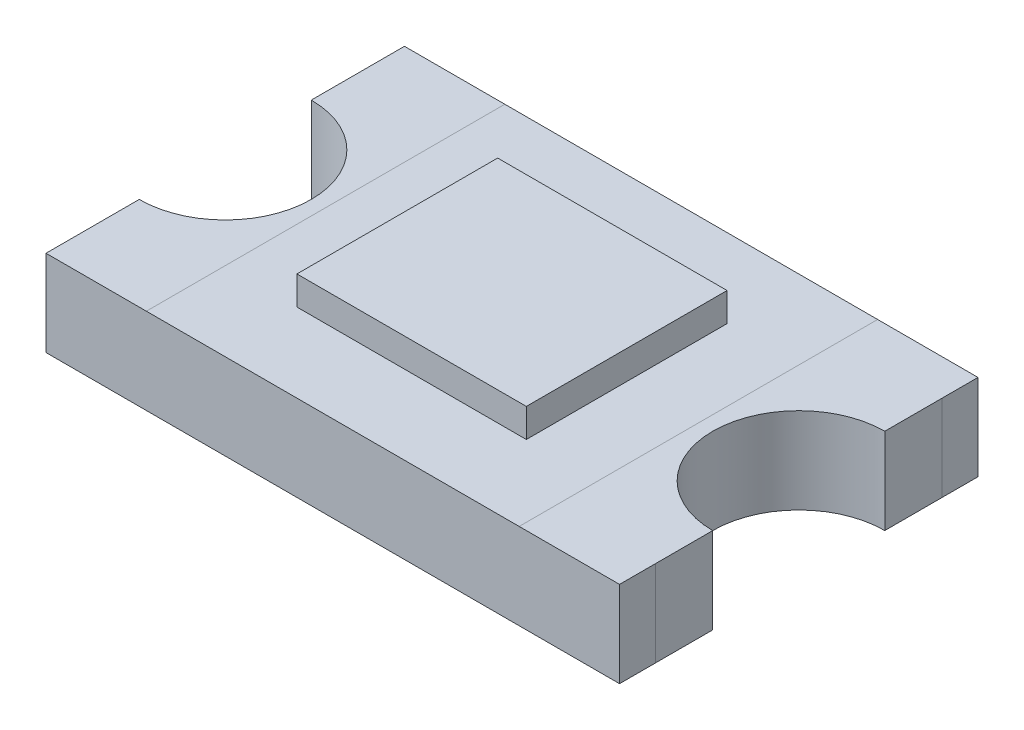
ISO-10303-21;
HEADER;
FILE_DESCRIPTION(('STEP AP214'),'2;1');
FILE_NAME('part.step','',(''),(''),'','','');
FILE_SCHEMA(('AUTOMOTIVE_DESIGN { 1 0 10303 214 1 1 1 1 }'));
ENDSEC;
DATA;
#1=APPLICATION_CONTEXT('core data for automotive mechanical design processes');
#2=APPLICATION_PROTOCOL_DEFINITION('international standard','automotive_design',2000,#1);
#3=PRODUCT_CONTEXT('',#1,'mechanical');
#4=PRODUCT('Part','Part','',(#3));
#5=PRODUCT_RELATED_PRODUCT_CATEGORY('part','',(#4));
#6=PRODUCT_DEFINITION_FORMATION('','',#4);
#7=PRODUCT_DEFINITION_CONTEXT('part definition',#1,'design');
#8=PRODUCT_DEFINITION('design','',#6,#7);
#9=PRODUCT_DEFINITION_SHAPE('','',#8);
#10=(LENGTH_UNIT() NAMED_UNIT(*) SI_UNIT(.MILLI.,.METRE.));
#11=(NAMED_UNIT(*) PLANE_ANGLE_UNIT() SI_UNIT($,.RADIAN.));
#12=(NAMED_UNIT(*) SI_UNIT($,.STERADIAN.) SOLID_ANGLE_UNIT());
#13=UNCERTAINTY_MEASURE_WITH_UNIT(LENGTH_MEASURE(1.E-05),#10,'distance_accuracy_value','');
#14=(GEOMETRIC_REPRESENTATION_CONTEXT(3) GLOBAL_UNCERTAINTY_ASSIGNED_CONTEXT((#13)) GLOBAL_UNIT_ASSIGNED_CONTEXT((#10,
#11,#12)) REPRESENTATION_CONTEXT('',''));
#15=CARTESIAN_POINT('',(0.,0.,0.));
#16=DIRECTION('',(0.,0.,1.));
#17=DIRECTION('',(1.,0.,0.));
#18=AXIS2_PLACEMENT_3D('',#15,#16,#17);
#19=CARTESIAN_POINT('',(1.,0.,0.));
#20=DIRECTION('',(0.,1.,0.));
#21=DIRECTION('',(1.,0.,0.));
#22=AXIS2_PLACEMENT_3D('',#19,#20,#21);
#23=PLANE('',#22);
#24=DIRECTION('',(0.,0.,1.));
#25=VECTOR('',#24,1.);
#26=CARTESIAN_POINT('',(-1.,0.,-0.3));
#27=LINE('',#26,#25);
#28=CARTESIAN_POINT('',(-1.,0.,-0.575));
#29=VERTEX_POINT('',#28);
#30=CARTESIAN_POINT('',(-1.,0.,-0.5));
#31=VERTEX_POINT('',#30);
#32=EDGE_CURVE('P0_E340',#29,#31,#27,.T.);
#33=ORIENTED_EDGE('',*,*,#32,.F.);
#34=DIRECTION('',(1.,0.,0.));
#35=VECTOR('',#34,1.);
#36=CARTESIAN_POINT('',(1.,0.,-0.575));
#37=LINE('',#36,#35);
#38=CARTESIAN_POINT('',(-0.6,0.,-0.575));
#39=VERTEX_POINT('',#38);
#40=EDGE_CURVE('P0_E317',#29,#39,#37,.T.);
#41=ORIENTED_EDGE('',*,*,#40,.T.);
#42=DIRECTION('',(0.,0.,1.));
#43=VECTOR('',#42,1.);
#44=CARTESIAN_POINT('',(-0.6,0.,0.));
#45=LINE('',#44,#43);
#46=CARTESIAN_POINT('',(-0.6,0.,0.575));
#47=VERTEX_POINT('',#46);
#48=EDGE_CURVE('P0_E309',#39,#47,#45,.T.);
#49=ORIENTED_EDGE('',*,*,#48,.T.);
#50=DIRECTION('',(-1.,0.,0.));
#51=VECTOR('',#50,1.);
#52=CARTESIAN_POINT('',(1.,0.,0.575));
#53=LINE('',#52,#51);
#54=CARTESIAN_POINT('',(-1.,0.,0.575));
#55=VERTEX_POINT('',#54);
#56=EDGE_CURVE('P0_E227',#47,#55,#53,.T.);
#57=ORIENTED_EDGE('',*,*,#56,.T.);
#58=DIRECTION('',(0.,0.,1.));
#59=VECTOR('',#58,1.);
#60=CARTESIAN_POINT('',(-1.,0.,0.625));
#61=LINE('',#60,#59);
#62=CARTESIAN_POINT('',(-1.,0.,0.5));
#63=VERTEX_POINT('',#62);
#64=EDGE_CURVE('P0_E243',#63,#55,#61,.T.);
#65=ORIENTED_EDGE('',*,*,#64,.F.);
#66=DIRECTION('',(0.,0.,1.));
#67=VECTOR('',#66,1.);
#68=CARTESIAN_POINT('',(-1.,0.,0.625));
#69=LINE('',#68,#67);
#70=CARTESIAN_POINT('',(-1.,0.,0.3));
#71=VERTEX_POINT('',#70);
#72=EDGE_CURVE('P0_E46',#71,#63,#69,.T.);
#73=ORIENTED_EDGE('',*,*,#72,.F.);
#74=CARTESIAN_POINT('',(-1.,0.,0.));
#75=DIRECTION('',(0.,-1.,0.));
#76=DIRECTION('',(0.,0.,1.));
#77=AXIS2_PLACEMENT_3D('',#74,#75,#76);
#78=CIRCLE('',#77,0.3);
#79=CARTESIAN_POINT('',(-1.,0.,-0.3));
#80=VERTEX_POINT('',#79);
#81=EDGE_CURVE('P0_E379',#80,#71,#78,.T.);
#82=ORIENTED_EDGE('',*,*,#81,.F.);
#83=DIRECTION('',(0.,0.,1.));
#84=VECTOR('',#83,1.);
#85=CARTESIAN_POINT('',(-1.,0.,-0.3));
#86=LINE('',#85,#84);
#87=EDGE_CURVE('P0_E435',#31,#80,#86,.T.);
#88=ORIENTED_EDGE('',*,*,#87,.F.);
#89=EDGE_LOOP('',(#33,#41,#49,#57,#65,#73,#82,#88));
#90=FACE_BOUND('',#89,.T.);
#91=ADVANCED_FACE('P0_F17',(#90),#23,.F.);
#92=CARTESIAN_POINT('',(1.,0.3,0.));
#93=DIRECTION('',(0.,1.,0.));
#94=DIRECTION('',(1.,0.,0.));
#95=AXIS2_PLACEMENT_3D('',#92,#93,#94);
#96=PLANE('',#95);
#97=DIRECTION('',(0.,0.,-1.));
#98=VECTOR('',#97,1.);
#99=CARTESIAN_POINT('',(0.65,0.3,0.));
#100=LINE('',#99,#98);
#101=CARTESIAN_POINT('',(0.65,0.3,0.625));
#102=VERTEX_POINT('',#101);
#103=CARTESIAN_POINT('',(0.65,0.3,-0.625));
#104=VERTEX_POINT('',#103);
#105=EDGE_CURVE('P0_E275',#102,#104,#100,.T.);
#106=ORIENTED_EDGE('',*,*,#105,.F.);
#107=DIRECTION('',(1.,0.,0.));
#108=VECTOR('',#107,1.);
#109=CARTESIAN_POINT('',(-1.,0.3,0.625));
#110=LINE('',#109,#108);
#111=CARTESIAN_POINT('',(1.,0.3,0.625));
#112=VERTEX_POINT('',#111);
#113=EDGE_CURVE('P0_E370',#102,#112,#110,.T.);
#114=ORIENTED_EDGE('',*,*,#113,.T.);
#115=DIRECTION('',(0.,0.,-1.));
#116=VECTOR('',#115,1.);
#117=CARTESIAN_POINT('',(1.,0.3,0.625));
#118=LINE('',#117,#116);
#119=CARTESIAN_POINT('',(1.,0.3,0.5));
#120=VERTEX_POINT('',#119);
#121=EDGE_CURVE('P0_E258',#112,#120,#118,.T.);
#122=ORIENTED_EDGE('',*,*,#121,.T.);
#123=DIRECTION('',(0.,0.,-1.));
#124=VECTOR('',#123,1.);
#125=CARTESIAN_POINT('',(1.,0.3,0.625));
#126=LINE('',#125,#124);
#127=CARTESIAN_POINT('',(1.,0.3,0.3));
#128=VERTEX_POINT('',#127);
#129=EDGE_CURVE('P0_E287',#120,#128,#126,.T.);
#130=ORIENTED_EDGE('',*,*,#129,.T.);
#131=CARTESIAN_POINT('',(1.,0.3,0.));
#132=DIRECTION('',(0.,-1.,0.));
#133=DIRECTION('',(0.,0.,1.));
#134=AXIS2_PLACEMENT_3D('',#131,#132,#133);
#135=CIRCLE('',#134,0.3);
#136=CARTESIAN_POINT('',(1.,0.3,-0.3));
#137=VERTEX_POINT('',#136);
#138=EDGE_CURVE('P0_E25',#128,#137,#135,.T.);
#139=ORIENTED_EDGE('',*,*,#138,.T.);
#140=DIRECTION('',(0.,0.,-1.));
#141=VECTOR('',#140,1.);
#142=CARTESIAN_POINT('',(1.,0.3,-0.3));
#143=LINE('',#142,#141);
#144=CARTESIAN_POINT('',(1.,0.3,-0.5));
#145=VERTEX_POINT('',#144);
#146=EDGE_CURVE('P0_E394',#137,#145,#143,.T.);
#147=ORIENTED_EDGE('',*,*,#146,.T.);
#148=DIRECTION('',(0.,0.,-1.));
#149=VECTOR('',#148,1.);
#150=CARTESIAN_POINT('',(1.,0.3,-0.3));
#151=LINE('',#150,#149);
#152=CARTESIAN_POINT('',(1.,0.3,-0.625));
#153=VERTEX_POINT('',#152);
#154=EDGE_CURVE('P0_E11',#145,#153,#151,.T.);
#155=ORIENTED_EDGE('',*,*,#154,.T.);
#156=DIRECTION('',(-1.,0.,0.));
#157=VECTOR('',#156,1.);
#158=CARTESIAN_POINT('',(-1.,0.3,-0.625));
#159=LINE('',#158,#157);
#160=EDGE_CURVE('P0_E341',#153,#104,#159,.T.);
#161=ORIENTED_EDGE('',*,*,#160,.T.);
#162=EDGE_LOOP('',(#106,#114,#122,#130,#139,#147,#155,#161));
#163=FACE_BOUND('',#162,.T.);
#164=ADVANCED_FACE('P0_F392',(#163),#96,.T.);
#165=CARTESIAN_POINT('',(1.,0.3,-0.3));
#166=DIRECTION('',(-1.,0.,0.));
#167=DIRECTION('',(0.,0.,1.));
#168=AXIS2_PLACEMENT_3D('',#165,#166,#167);
#169=PLANE('',#168);
#170=ORIENTED_EDGE('',*,*,#154,.F.);
#171=DIRECTION('',(0.,-1.,0.));
#172=VECTOR('',#171,1.);
#173=CARTESIAN_POINT('',(1.,0.3,-0.5));
#174=LINE('',#173,#172);
#175=CARTESIAN_POINT('',(1.,0.,-0.5));
#176=VERTEX_POINT('',#175);
#177=EDGE_CURVE('P0_E408',#145,#176,#174,.T.);
#178=ORIENTED_EDGE('',*,*,#177,.T.);
#179=DIRECTION('',(0.,0.,-1.));
#180=VECTOR('',#179,1.);
#181=CARTESIAN_POINT('',(1.,0.,-0.3));
#182=LINE('',#181,#180);
#183=CARTESIAN_POINT('',(1.,0.,-0.575));
#184=VERTEX_POINT('',#183);
#185=EDGE_CURVE('P0_E358',#176,#184,#182,.T.);
#186=ORIENTED_EDGE('',*,*,#185,.T.);
#187=DIRECTION('',(0.,0.,-1.));
#188=VECTOR('',#187,1.);
#189=CARTESIAN_POINT('',(1.,0.,-0.3));
#190=LINE('',#189,#188);
#191=CARTESIAN_POINT('',(1.,0.,-0.625));
#192=VERTEX_POINT('',#191);
#193=EDGE_CURVE('P0_E328',#184,#192,#190,.T.);
#194=ORIENTED_EDGE('',*,*,#193,.T.);
#195=DIRECTION('',(0.,-1.,0.));
#196=VECTOR('',#195,1.);
#197=CARTESIAN_POINT('',(1.,0.3,-0.625));
#198=LINE('',#197,#196);
#199=EDGE_CURVE('P0_E337',#153,#192,#198,.T.);
#200=ORIENTED_EDGE('',*,*,#199,.F.);
#201=EDGE_LOOP('',(#170,#178,#186,#194,#200));
#202=FACE_BOUND('',#201,.T.);
#203=ADVANCED_FACE('P0_F485',(#202),#169,.F.);
#204=CARTESIAN_POINT('',(1.,0.3,0.));
#205=DIRECTION('',(0.,-1.,0.));
#206=DIRECTION('',(0.,0.,-1.));
#207=AXIS2_PLACEMENT_3D('',#204,#205,#206);
#208=CYLINDRICAL_SURFACE('',#207,0.3);
#209=CARTESIAN_POINT('',(1.,0.,0.));
#210=DIRECTION('',(0.,-1.,0.));
#211=DIRECTION('',(0.,0.,1.));
#212=AXIS2_PLACEMENT_3D('',#209,#210,#211);
#213=CIRCLE('',#212,0.3);
#214=CARTESIAN_POINT('',(1.,0.,0.3));
#215=VERTEX_POINT('',#214);
#216=CARTESIAN_POINT('',(1.,0.,-0.3));
#217=VERTEX_POINT('',#216);
#218=EDGE_CURVE('P0_E365',#215,#217,#213,.T.);
#219=ORIENTED_EDGE('',*,*,#218,.T.);
#220=DIRECTION('',(0.,-1.,0.));
#221=VECTOR('',#220,1.);
#222=CARTESIAN_POINT('',(1.,0.3,-0.3));
#223=LINE('',#222,#221);
#224=EDGE_CURVE('P0_E397',#137,#217,#223,.T.);
#225=ORIENTED_EDGE('',*,*,#224,.F.);
#226=ORIENTED_EDGE('',*,*,#138,.F.);
#227=DIRECTION('',(0.,-1.,0.));
#228=VECTOR('',#227,1.);
#229=CARTESIAN_POINT('',(1.,0.3,0.3));
#230=LINE('',#229,#228);
#231=EDGE_CURVE('P0_E284',#128,#215,#230,.T.);
#232=ORIENTED_EDGE('',*,*,#231,.T.);
#233=EDGE_LOOP('',(#219,#225,#226,#232));
#234=FACE_BOUND('',#233,.T.);
#235=ADVANCED_FACE('P0_F398',(#234),#208,.F.);
#236=CARTESIAN_POINT('',(1.,0.3,0.625));
#237=DIRECTION('',(-1.,0.,0.));
#238=DIRECTION('',(0.,0.,1.));
#239=AXIS2_PLACEMENT_3D('',#236,#237,#238);
#240=PLANE('',#239);
#241=ORIENTED_EDGE('',*,*,#129,.F.);
#242=DIRECTION('',(0.,-1.,0.));
#243=VECTOR('',#242,1.);
#244=CARTESIAN_POINT('',(1.,0.3,0.5));
#245=LINE('',#244,#243);
#246=CARTESIAN_POINT('',(1.,0.,0.5));
#247=VERTEX_POINT('',#246);
#248=EDGE_CURVE('P0_E254',#120,#247,#245,.T.);
#249=ORIENTED_EDGE('',*,*,#248,.T.);
#250=DIRECTION('',(0.,0.,-1.));
#251=VECTOR('',#250,1.);
#252=CARTESIAN_POINT('',(1.,0.,0.625));
#253=LINE('',#252,#251);
#254=EDGE_CURVE('P0_E362',#247,#215,#253,.T.);
#255=ORIENTED_EDGE('',*,*,#254,.T.);
#256=ORIENTED_EDGE('',*,*,#231,.F.);
#257=EDGE_LOOP('',(#241,#249,#255,#256));
#258=FACE_BOUND('',#257,.T.);
#259=ADVANCED_FACE('P0_F497',(#258),#240,.F.);
#260=CARTESIAN_POINT('',(-1.,0.3,0.625));
#261=DIRECTION('',(0.,0.,-1.));
#262=DIRECTION('',(0.,-1.,0.));
#263=AXIS2_PLACEMENT_3D('',#260,#261,#262);
#264=PLANE('',#263);
#265=DIRECTION('',(1.,0.,0.));
#266=VECTOR('',#265,1.);
#267=CARTESIAN_POINT('',(-1.,0.,0.625));
#268=LINE('',#267,#266);
#269=CARTESIAN_POINT('',(-1.,0.,0.625));
#270=VERTEX_POINT('',#269);
#271=CARTESIAN_POINT('',(1.,0.,0.625));
#272=VERTEX_POINT('',#271);
#273=EDGE_CURVE('P0_E214',#270,#272,#268,.T.);
#274=ORIENTED_EDGE('',*,*,#273,.T.);
#275=DIRECTION('',(0.,-1.,0.));
#276=VECTOR('',#275,1.);
#277=CARTESIAN_POINT('',(1.,0.3,0.625));
#278=LINE('',#277,#276);
#279=EDGE_CURVE('P0_E261',#112,#272,#278,.T.);
#280=ORIENTED_EDGE('',*,*,#279,.F.);
#281=ORIENTED_EDGE('',*,*,#113,.F.);
#282=DIRECTION('',(1.,0.,0.));
#283=VECTOR('',#282,1.);
#284=CARTESIAN_POINT('',(-1.,0.3,0.625));
#285=LINE('',#284,#283);
#286=CARTESIAN_POINT('',(-0.65,0.3,0.625));
#287=VERTEX_POINT('',#286);
#288=EDGE_CURVE('P0_E271',#287,#102,#285,.T.);
#289=ORIENTED_EDGE('',*,*,#288,.F.);
#290=DIRECTION('',(1.,0.,0.));
#291=VECTOR('',#290,1.);
#292=CARTESIAN_POINT('',(-1.,0.3,0.625));
#293=LINE('',#292,#291);
#294=CARTESIAN_POINT('',(-1.,0.3,0.625));
#295=VERTEX_POINT('',#294);
#296=EDGE_CURVE('P0_E234',#295,#287,#293,.T.);
#297=ORIENTED_EDGE('',*,*,#296,.F.);
#298=DIRECTION('',(0.,-1.,0.));
#299=VECTOR('',#298,1.);
#300=CARTESIAN_POINT('',(-1.,0.3,0.625));
#301=LINE('',#300,#299);
#302=EDGE_CURVE('P0_E231',#295,#270,#301,.T.);
#303=ORIENTED_EDGE('',*,*,#302,.T.);
#304=EDGE_LOOP('',(#274,#280,#281,#289,#297,#303));
#305=FACE_BOUND('',#304,.T.);
#306=ADVANCED_FACE('P0_F232',(#305),#264,.F.);
#307=CARTESIAN_POINT('',(-1.,0.3,0.625));
#308=DIRECTION('',(1.,0.,0.));
#309=DIRECTION('',(0.,1.,0.));
#310=AXIS2_PLACEMENT_3D('',#307,#308,#309);
#311=PLANE('',#310);
#312=ORIENTED_EDGE('',*,*,#72,.T.);
#313=DIRECTION('',(0.,1.,0.));
#314=VECTOR('',#313,1.);
#315=CARTESIAN_POINT('',(-1.,0.3,0.5));
#316=LINE('',#315,#314);
#317=CARTESIAN_POINT('',(-1.,0.3,0.5));
#318=VERTEX_POINT('',#317);
#319=EDGE_CURVE('P0_E249',#63,#318,#316,.T.);
#320=ORIENTED_EDGE('',*,*,#319,.T.);
#321=DIRECTION('',(0.,0.,1.));
#322=VECTOR('',#321,1.);
#323=CARTESIAN_POINT('',(-1.,0.3,0.625));
#324=LINE('',#323,#322);
#325=CARTESIAN_POINT('',(-1.,0.3,0.3));
#326=VERTEX_POINT('',#325);
#327=EDGE_CURVE('P0_E301',#326,#318,#324,.T.);
#328=ORIENTED_EDGE('',*,*,#327,.F.);
#329=DIRECTION('',(0.,-1.,0.));
#330=VECTOR('',#329,1.);
#331=CARTESIAN_POINT('',(-1.,0.3,0.3));
#332=LINE('',#331,#330);
#333=EDGE_CURVE('P0_E371',#326,#71,#332,.T.);
#334=ORIENTED_EDGE('',*,*,#333,.T.);
#335=EDGE_LOOP('',(#312,#320,#328,#334));
#336=FACE_BOUND('',#335,.T.);
#337=ADVANCED_FACE('P0_F465',(#336),#311,.F.);
#338=CARTESIAN_POINT('',(-1.,0.3,0.));
#339=DIRECTION('',(0.,-1.,0.));
#340=DIRECTION('',(0.,0.,-1.));
#341=AXIS2_PLACEMENT_3D('',#338,#339,#340);
#342=CYLINDRICAL_SURFACE('',#341,0.3);
#343=ORIENTED_EDGE('',*,*,#81,.T.);
#344=ORIENTED_EDGE('',*,*,#333,.F.);
#345=CARTESIAN_POINT('',(-1.,0.3,0.));
#346=DIRECTION('',(0.,-1.,0.));
#347=DIRECTION('',(0.,0.,1.));
#348=AXIS2_PLACEMENT_3D('',#345,#346,#347);
#349=CIRCLE('',#348,0.3);
#350=CARTESIAN_POINT('',(-1.,0.3,-0.3));
#351=VERTEX_POINT('',#350);
#352=EDGE_CURVE('P0_E297',#351,#326,#349,.T.);
#353=ORIENTED_EDGE('',*,*,#352,.F.);
#354=DIRECTION('',(0.,-1.,0.));
#355=VECTOR('',#354,1.);
#356=CARTESIAN_POINT('',(-1.,0.3,-0.3));
#357=LINE('',#356,#355);
#358=EDGE_CURVE('P0_E436',#351,#80,#357,.T.);
#359=ORIENTED_EDGE('',*,*,#358,.T.);
#360=EDGE_LOOP('',(#343,#344,#353,#359));
#361=FACE_BOUND('',#360,.T.);
#362=ADVANCED_FACE('P0_F462',(#361),#342,.F.);
#363=CARTESIAN_POINT('',(-1.,0.3,-0.3));
#364=DIRECTION('',(1.,0.,0.));
#365=DIRECTION('',(0.,1.,0.));
#366=AXIS2_PLACEMENT_3D('',#363,#364,#365);
#367=PLANE('',#366);
#368=ORIENTED_EDGE('',*,*,#32,.T.);
#369=DIRECTION('',(0.,1.,0.));
#370=VECTOR('',#369,1.);
#371=CARTESIAN_POINT('',(-1.,0.3,-0.5));
#372=LINE('',#371,#370);
#373=CARTESIAN_POINT('',(-1.,0.3,-0.5));
#374=VERTEX_POINT('',#373);
#375=EDGE_CURVE('P0_E432',#31,#374,#372,.T.);
#376=ORIENTED_EDGE('',*,*,#375,.T.);
#377=DIRECTION('',(0.,0.,1.));
#378=VECTOR('',#377,1.);
#379=CARTESIAN_POINT('',(-1.,0.3,-0.3));
#380=LINE('',#379,#378);
#381=CARTESIAN_POINT('',(-1.,0.3,-0.625));
#382=VERTEX_POINT('',#381);
#383=EDGE_CURVE('P0_E294',#382,#374,#380,.T.);
#384=ORIENTED_EDGE('',*,*,#383,.F.);
#385=DIRECTION('',(0.,-1.,0.));
#386=VECTOR('',#385,1.);
#387=CARTESIAN_POINT('',(-1.,0.3,-0.625));
#388=LINE('',#387,#386);
#389=CARTESIAN_POINT('',(-1.,0.,-0.625));
#390=VERTEX_POINT('',#389);
#391=EDGE_CURVE('P0_E359',#382,#390,#388,.T.);
#392=ORIENTED_EDGE('',*,*,#391,.T.);
#393=DIRECTION('',(0.,0.,1.));
#394=VECTOR('',#393,1.);
#395=CARTESIAN_POINT('',(-1.,0.,-0.3));
#396=LINE('',#395,#394);
#397=EDGE_CURVE('P0_E320',#390,#29,#396,.T.);
#398=ORIENTED_EDGE('',*,*,#397,.T.);
#399=EDGE_LOOP('',(#368,#376,#384,#392,#398));
#400=FACE_BOUND('',#399,.T.);
#401=ADVANCED_FACE('P0_F478',(#400),#367,.F.);
#402=CARTESIAN_POINT('',(-1.,0.3,-0.625));
#403=DIRECTION('',(0.,0.,1.));
#404=DIRECTION('',(1.,0.,0.));
#405=AXIS2_PLACEMENT_3D('',#402,#403,#404);
#406=PLANE('',#405);
#407=DIRECTION('',(-1.,0.,0.));
#408=VECTOR('',#407,1.);
#409=CARTESIAN_POINT('',(-1.,0.,-0.625));
#410=LINE('',#409,#408);
#411=EDGE_CURVE('P0_E324',#192,#390,#410,.T.);
#412=ORIENTED_EDGE('',*,*,#411,.T.);
#413=ORIENTED_EDGE('',*,*,#391,.F.);
#414=DIRECTION('',(-1.,0.,0.));
#415=VECTOR('',#414,1.);
#416=CARTESIAN_POINT('',(-1.,0.3,-0.625));
#417=LINE('',#416,#415);
#418=CARTESIAN_POINT('',(-0.65,0.3,-0.625));
#419=VERTEX_POINT('',#418);
#420=EDGE_CURVE('P0_E290',#419,#382,#417,.T.);
#421=ORIENTED_EDGE('',*,*,#420,.F.);
#422=DIRECTION('',(-1.,0.,0.));
#423=VECTOR('',#422,1.);
#424=CARTESIAN_POINT('',(-1.,0.3,-0.625));
#425=LINE('',#424,#423);
#426=EDGE_CURVE('P0_E279',#104,#419,#425,.T.);
#427=ORIENTED_EDGE('',*,*,#426,.F.);
#428=ORIENTED_EDGE('',*,*,#160,.F.);
#429=ORIENTED_EDGE('',*,*,#199,.T.);
#430=EDGE_LOOP('',(#412,#413,#421,#427,#428,#429));
#431=FACE_BOUND('',#430,.T.);
#432=ADVANCED_FACE('P0_F474',(#431),#406,.F.);
#433=CARTESIAN_POINT('',(1.,0.,0.));
#434=DIRECTION('',(0.,1.,0.));
#435=DIRECTION('',(1.,0.,0.));
#436=AXIS2_PLACEMENT_3D('',#433,#434,#435);
#437=PLANE('',#436);
#438=DIRECTION('',(0.,0.,-1.));
#439=VECTOR('',#438,1.);
#440=CARTESIAN_POINT('',(1.,0.,0.625));
#441=LINE('',#440,#439);
#442=CARTESIAN_POINT('',(1.,0.,0.575));
#443=VERTEX_POINT('',#442);
#444=EDGE_CURVE('P0_E267',#443,#247,#441,.T.);
#445=ORIENTED_EDGE('',*,*,#444,.F.);
#446=DIRECTION('',(-1.,0.,0.));
#447=VECTOR('',#446,1.);
#448=CARTESIAN_POINT('',(1.,0.,0.575));
#449=LINE('',#448,#447);
#450=CARTESIAN_POINT('',(0.6,0.,0.575));
#451=VERTEX_POINT('',#450);
#452=EDGE_CURVE('P0_E228',#443,#451,#449,.T.);
#453=ORIENTED_EDGE('',*,*,#452,.T.);
#454=DIRECTION('',(0.,0.,-1.));
#455=VECTOR('',#454,1.);
#456=CARTESIAN_POINT('',(0.6,0.,0.));
#457=LINE('',#456,#455);
#458=CARTESIAN_POINT('',(0.6,0.,-0.575));
#459=VERTEX_POINT('',#458);
#460=EDGE_CURVE('P0_E336',#451,#459,#457,.T.);
#461=ORIENTED_EDGE('',*,*,#460,.T.);
#462=DIRECTION('',(1.,0.,0.));
#463=VECTOR('',#462,1.);
#464=CARTESIAN_POINT('',(1.,0.,-0.575));
#465=LINE('',#464,#463);
#466=EDGE_CURVE('P0_E332',#459,#184,#465,.T.);
#467=ORIENTED_EDGE('',*,*,#466,.T.);
#468=ORIENTED_EDGE('',*,*,#185,.F.);
#469=DIRECTION('',(0.,0.,-1.));
#470=VECTOR('',#469,1.);
#471=CARTESIAN_POINT('',(1.,0.,-0.3));
#472=LINE('',#471,#470);
#473=EDGE_CURVE('P0_E404',#217,#176,#472,.T.);
#474=ORIENTED_EDGE('',*,*,#473,.F.);
#475=ORIENTED_EDGE('',*,*,#218,.F.);
#476=ORIENTED_EDGE('',*,*,#254,.F.);
#477=EDGE_LOOP('',(#445,#453,#461,#467,#468,#474,#475,#476));
#478=FACE_BOUND('',#477,.T.);
#479=ADVANCED_FACE('P0_F503',(#478),#437,.F.);
#480=CARTESIAN_POINT('',(1.,0.,0.));
#481=DIRECTION('',(0.,1.,0.));
#482=DIRECTION('',(1.,0.,0.));
#483=AXIS2_PLACEMENT_3D('',#480,#481,#482);
#484=PLANE('',#483);
#485=DIRECTION('',(0.,0.,1.));
#486=VECTOR('',#485,1.);
#487=CARTESIAN_POINT('',(-0.0375,0.,0.));
#488=LINE('',#487,#486);
#489=CARTESIAN_POINT('',(-0.0375,0.,0.0625));
#490=VERTEX_POINT('',#489);
#491=CARTESIAN_POINT('',(-0.0375,0.,0.525));
#492=VERTEX_POINT('',#491);
#493=EDGE_CURVE('P0_E348',#490,#492,#488,.T.);
#494=ORIENTED_EDGE('',*,*,#493,.T.);
#495=DIRECTION('',(-1.,0.,0.));
#496=VECTOR('',#495,1.);
#497=CARTESIAN_POINT('',(1.,0.,0.525));
#498=LINE('',#497,#496);
#499=CARTESIAN_POINT('',(-0.1625,0.,0.525));
#500=VERTEX_POINT('',#499);
#501=EDGE_CURVE('P0_E344',#492,#500,#498,.T.);
#502=ORIENTED_EDGE('',*,*,#501,.T.);
#503=DIRECTION('',(0.,0.,-1.));
#504=VECTOR('',#503,1.);
#505=CARTESIAN_POINT('',(-0.1625,0.,0.));
#506=LINE('',#505,#504);
#507=CARTESIAN_POINT('',(-0.1625,0.,-0.525));
#508=VERTEX_POINT('',#507);
#509=EDGE_CURVE('P0_E313',#500,#508,#506,.T.);
#510=ORIENTED_EDGE('',*,*,#509,.T.);
#511=DIRECTION('',(1.,0.,0.));
#512=VECTOR('',#511,1.);
#513=CARTESIAN_POINT('',(1.,0.,-0.525));
#514=LINE('',#513,#512);
#515=CARTESIAN_POINT('',(-0.0375,0.,-0.525));
#516=VERTEX_POINT('',#515);
#517=EDGE_CURVE('P0_E310',#508,#516,#514,.T.);
#518=ORIENTED_EDGE('',*,*,#517,.T.);
#519=DIRECTION('',(0.,0.,1.));
#520=VECTOR('',#519,1.);
#521=CARTESIAN_POINT('',(-0.0375,0.,0.));
#522=LINE('',#521,#520);
#523=CARTESIAN_POINT('',(-0.0375,0.,-0.0625));
#524=VERTEX_POINT('',#523);
#525=EDGE_CURVE('P0_E314',#516,#524,#522,.T.);
#526=ORIENTED_EDGE('',*,*,#525,.T.);
#527=DIRECTION('',(1.,0.,0.));
#528=VECTOR('',#527,1.);
#529=CARTESIAN_POINT('',(1.,0.,-0.0625));
#530=LINE('',#529,#528);
#531=CARTESIAN_POINT('',(0.1625,0.,-0.0625));
#532=VERTEX_POINT('',#531);
#533=EDGE_CURVE('P0_E355',#524,#532,#530,.T.);
#534=ORIENTED_EDGE('',*,*,#533,.T.);
#535=DIRECTION('',(0.,0.,1.));
#536=VECTOR('',#535,1.);
#537=CARTESIAN_POINT('',(0.1625,0.,0.));
#538=LINE('',#537,#536);
#539=CARTESIAN_POINT('',(0.1625,0.,0.0625));
#540=VERTEX_POINT('',#539);
#541=EDGE_CURVE('P0_E352',#532,#540,#538,.T.);
#542=ORIENTED_EDGE('',*,*,#541,.T.);
#543=DIRECTION('',(-1.,0.,0.));
#544=VECTOR('',#543,1.);
#545=CARTESIAN_POINT('',(1.,0.,0.0625));
#546=LINE('',#545,#544);
#547=EDGE_CURVE('P0_E349',#540,#490,#546,.T.);
#548=ORIENTED_EDGE('',*,*,#547,.T.);
#549=EDGE_LOOP('',(#494,#502,#510,#518,#526,#534,#542,#548));
#550=FACE_BOUND('',#549,.T.);
#551=ADVANCED_FACE('P0_F508',(#550),#484,.F.);
#552=CARTESIAN_POINT('',(1.,0.,0.));
#553=DIRECTION('',(0.,1.,0.));
#554=DIRECTION('',(1.,0.,0.));
#555=AXIS2_PLACEMENT_3D('',#552,#553,#554);
#556=PLANE('',#555);
#557=ORIENTED_EDGE('',*,*,#501,.F.);
#558=ORIENTED_EDGE('',*,*,#493,.F.);
#559=ORIENTED_EDGE('',*,*,#547,.F.);
#560=ORIENTED_EDGE('',*,*,#541,.F.);
#561=ORIENTED_EDGE('',*,*,#533,.F.);
#562=ORIENTED_EDGE('',*,*,#525,.F.);
#563=ORIENTED_EDGE('',*,*,#517,.F.);
#564=ORIENTED_EDGE('',*,*,#509,.F.);
#565=EDGE_LOOP('',(#557,#558,#559,#560,#561,#562,#563,#564));
#566=FACE_BOUND('',#565,.T.);
#567=ORIENTED_EDGE('',*,*,#452,.F.);
#568=DIRECTION('',(0.,0.,-1.));
#569=VECTOR('',#568,1.);
#570=CARTESIAN_POINT('',(1.,0.,0.625));
#571=LINE('',#570,#569);
#572=EDGE_CURVE('P0_E222',#272,#443,#571,.T.);
#573=ORIENTED_EDGE('',*,*,#572,.F.);
#574=ORIENTED_EDGE('',*,*,#273,.F.);
#575=DIRECTION('',(0.,0.,1.));
#576=VECTOR('',#575,1.);
#577=CARTESIAN_POINT('',(-1.,0.,0.625));
#578=LINE('',#577,#576);
#579=EDGE_CURVE('P0_E219',#55,#270,#578,.T.);
#580=ORIENTED_EDGE('',*,*,#579,.F.);
#581=ORIENTED_EDGE('',*,*,#56,.F.);
#582=ORIENTED_EDGE('',*,*,#48,.F.);
#583=ORIENTED_EDGE('',*,*,#40,.F.);
#584=ORIENTED_EDGE('',*,*,#397,.F.);
#585=ORIENTED_EDGE('',*,*,#411,.F.);
#586=ORIENTED_EDGE('',*,*,#193,.F.);
#587=ORIENTED_EDGE('',*,*,#466,.F.);
#588=ORIENTED_EDGE('',*,*,#460,.F.);
#589=EDGE_LOOP('',(#567,#573,#574,#580,#581,#582,#583,#584,#585,#586,#587,#588));
#590=FACE_BOUND('',#589,.T.);
#591=ADVANCED_FACE('P0_F216',(#566,#590),#556,.F.);
#592=CARTESIAN_POINT('',(1.,0.3,0.));
#593=DIRECTION('',(0.,1.,0.));
#594=DIRECTION('',(1.,0.,0.));
#595=AXIS2_PLACEMENT_3D('',#592,#593,#594);
#596=PLANE('',#595);
#597=ORIENTED_EDGE('',*,*,#296,.T.);
#598=DIRECTION('',(0.,0.,-1.));
#599=VECTOR('',#598,1.);
#600=CARTESIAN_POINT('',(-0.65,0.3,0.));
#601=LINE('',#600,#599);
#602=EDGE_CURVE('P0_E280',#287,#419,#601,.T.);
#603=ORIENTED_EDGE('',*,*,#602,.T.);
#604=ORIENTED_EDGE('',*,*,#420,.T.);
#605=ORIENTED_EDGE('',*,*,#383,.T.);
#606=DIRECTION('',(0.,0.,1.));
#607=VECTOR('',#606,1.);
#608=CARTESIAN_POINT('',(-1.,0.3,-0.3));
#609=LINE('',#608,#607);
#610=EDGE_CURVE('P0_E414',#374,#351,#609,.T.);
#611=ORIENTED_EDGE('',*,*,#610,.T.);
#612=ORIENTED_EDGE('',*,*,#352,.T.);
#613=ORIENTED_EDGE('',*,*,#327,.T.);
#614=DIRECTION('',(0.,0.,1.));
#615=VECTOR('',#614,1.);
#616=CARTESIAN_POINT('',(-1.,0.3,0.625));
#617=LINE('',#616,#615);
#618=EDGE_CURVE('P0_E239',#318,#295,#617,.T.);
#619=ORIENTED_EDGE('',*,*,#618,.T.);
#620=EDGE_LOOP('',(#597,#603,#604,#605,#611,#612,#613,#619));
#621=FACE_BOUND('',#620,.T.);
#622=ADVANCED_FACE('P0_F455',(#621),#596,.T.);
#623=CARTESIAN_POINT('',(1.,0.3,0.));
#624=DIRECTION('',(0.,1.,0.));
#625=DIRECTION('',(1.,0.,0.));
#626=AXIS2_PLACEMENT_3D('',#623,#624,#625);
#627=PLANE('',#626);
#628=ORIENTED_EDGE('',*,*,#288,.T.);
#629=ORIENTED_EDGE('',*,*,#105,.T.);
#630=ORIENTED_EDGE('',*,*,#426,.T.);
#631=ORIENTED_EDGE('',*,*,#602,.F.);
#632=EDGE_LOOP('',(#628,#629,#630,#631));
#633=FACE_BOUND('',#632,.T.);
#634=ADVANCED_FACE('P0_F468',(#633),#627,.T.);
#635=CARTESIAN_POINT('',(1.,0.3,0.625));
#636=DIRECTION('',(-1.,0.,0.));
#637=DIRECTION('',(0.,0.,1.));
#638=AXIS2_PLACEMENT_3D('',#635,#636,#637);
#639=PLANE('',#638);
#640=ORIENTED_EDGE('',*,*,#248,.F.);
#641=ORIENTED_EDGE('',*,*,#121,.F.);
#642=ORIENTED_EDGE('',*,*,#279,.T.);
#643=ORIENTED_EDGE('',*,*,#572,.T.);
#644=ORIENTED_EDGE('',*,*,#444,.T.);
#645=EDGE_LOOP('',(#640,#641,#642,#643,#644));
#646=FACE_BOUND('',#645,.T.);
#647=ADVANCED_FACE('P0_F520',(#646),#639,.F.);
#648=CARTESIAN_POINT('',(-1.,0.3,0.625));
#649=DIRECTION('',(1.,0.,0.));
#650=DIRECTION('',(0.,1.,0.));
#651=AXIS2_PLACEMENT_3D('',#648,#649,#650);
#652=PLANE('',#651);
#653=ORIENTED_EDGE('',*,*,#319,.F.);
#654=ORIENTED_EDGE('',*,*,#64,.T.);
#655=ORIENTED_EDGE('',*,*,#579,.T.);
#656=ORIENTED_EDGE('',*,*,#302,.F.);
#657=ORIENTED_EDGE('',*,*,#618,.F.);
#658=EDGE_LOOP('',(#653,#654,#655,#656,#657));
#659=FACE_BOUND('',#658,.T.);
#660=ADVANCED_FACE('P0_F242',(#659),#652,.F.);
#661=CARTESIAN_POINT('',(1.,0.3,-0.3));
#662=DIRECTION('',(-1.,0.,0.));
#663=DIRECTION('',(0.,0.,1.));
#664=AXIS2_PLACEMENT_3D('',#661,#662,#663);
#665=PLANE('',#664);
#666=ORIENTED_EDGE('',*,*,#177,.F.);
#667=ORIENTED_EDGE('',*,*,#146,.F.);
#668=ORIENTED_EDGE('',*,*,#224,.T.);
#669=ORIENTED_EDGE('',*,*,#473,.T.);
#670=EDGE_LOOP('',(#666,#667,#668,#669));
#671=FACE_BOUND('',#670,.T.);
#672=ADVANCED_FACE('P0_F406',(#671),#665,.F.);
#673=CARTESIAN_POINT('',(-1.,0.3,-0.3));
#674=DIRECTION('',(1.,0.,0.));
#675=DIRECTION('',(0.,1.,0.));
#676=AXIS2_PLACEMENT_3D('',#673,#674,#675);
#677=PLANE('',#676);
#678=ORIENTED_EDGE('',*,*,#375,.F.);
#679=ORIENTED_EDGE('',*,*,#87,.T.);
#680=ORIENTED_EDGE('',*,*,#358,.F.);
#681=ORIENTED_EDGE('',*,*,#610,.F.);
#682=EDGE_LOOP('',(#678,#679,#680,#681));
#683=FACE_BOUND('',#682,.T.);
#684=ADVANCED_FACE('P0_F459',(#683),#677,.F.);
#685=CLOSED_SHELL('',(#91,#164,#203,#235,#259,#306,#337,#362,#401,#432,#479,#551,#591,#622,#634,
#647,#660,#672,#684));
#686=MANIFOLD_SOLID_BREP('P0_B1',#685);
#687=CARTESIAN_POINT('',(0.,0.3,0.));
#688=DIRECTION('',(0.,-1.,0.));
#689=DIRECTION('',(0.,0.,-1.));
#690=AXIS2_PLACEMENT_3D('',#687,#688,#689);
#691=PLANE('',#690);
#692=DIRECTION('',(0.,0.,-1.));
#693=VECTOR('',#692,1.);
#694=CARTESIAN_POINT('',(0.4,0.3,0.35));
#695=LINE('',#694,#693);
#696=CARTESIAN_POINT('',(0.4,0.3,0.35));
#697=VERTEX_POINT('',#696);
#698=CARTESIAN_POINT('',(0.4,0.3,-0.35));
#699=VERTEX_POINT('',#698);
#700=EDGE_CURVE('P1_E80',#697,#699,#695,.T.);
#701=ORIENTED_EDGE('',*,*,#700,.F.);
#702=DIRECTION('',(1.,0.,0.));
#703=VECTOR('',#702,1.);
#704=CARTESIAN_POINT('',(-0.4,0.3,0.35));
#705=LINE('',#704,#703);
#706=CARTESIAN_POINT('',(-0.4,0.3,0.35));
#707=VERTEX_POINT('',#706);
#708=EDGE_CURVE('P1_E25',#707,#697,#705,.T.);
#709=ORIENTED_EDGE('',*,*,#708,.F.);
#710=DIRECTION('',(0.,0.,1.));
#711=VECTOR('',#710,1.);
#712=CARTESIAN_POINT('',(-0.4,0.3,0.35));
#713=LINE('',#712,#711);
#714=CARTESIAN_POINT('',(-0.4,0.3,-0.35));
#715=VERTEX_POINT('',#714);
#716=EDGE_CURVE('P1_E97',#715,#707,#713,.T.);
#717=ORIENTED_EDGE('',*,*,#716,.F.);
#718=DIRECTION('',(-1.,0.,0.));
#719=VECTOR('',#718,1.);
#720=CARTESIAN_POINT('',(-0.4,0.3,-0.35));
#721=LINE('',#720,#719);
#722=EDGE_CURVE('P1_E84',#699,#715,#721,.T.);
#723=ORIENTED_EDGE('',*,*,#722,.F.);
#724=EDGE_LOOP('',(#701,#709,#717,#723));
#725=FACE_BOUND('',#724,.T.);
#726=ADVANCED_FACE('P1_F17',(#725),#691,.T.);
#727=CARTESIAN_POINT('',(0.,0.4,0.));
#728=DIRECTION('',(0.,-1.,0.));
#729=DIRECTION('',(0.,0.,-1.));
#730=AXIS2_PLACEMENT_3D('',#727,#728,#729);
#731=PLANE('',#730);
#732=DIRECTION('',(0.,0.,-1.));
#733=VECTOR('',#732,1.);
#734=CARTESIAN_POINT('',(0.4,0.4,0.35));
#735=LINE('',#734,#733);
#736=CARTESIAN_POINT('',(0.4,0.4,0.35));
#737=VERTEX_POINT('',#736);
#738=CARTESIAN_POINT('',(0.4,0.4,-0.35));
#739=VERTEX_POINT('',#738);
#740=EDGE_CURVE('P1_E82',#737,#739,#735,.T.);
#741=ORIENTED_EDGE('',*,*,#740,.T.);
#742=DIRECTION('',(-1.,0.,0.));
#743=VECTOR('',#742,1.);
#744=CARTESIAN_POINT('',(-0.4,0.4,-0.35));
#745=LINE('',#744,#743);
#746=CARTESIAN_POINT('',(-0.4,0.4,-0.35));
#747=VERTEX_POINT('',#746);
#748=EDGE_CURVE('P1_E100',#739,#747,#745,.T.);
#749=ORIENTED_EDGE('',*,*,#748,.T.);
#750=DIRECTION('',(0.,0.,1.));
#751=VECTOR('',#750,1.);
#752=CARTESIAN_POINT('',(-0.4,0.4,0.35));
#753=LINE('',#752,#751);
#754=CARTESIAN_POINT('',(-0.4,0.4,0.35));
#755=VERTEX_POINT('',#754);
#756=EDGE_CURVE('P1_E74',#747,#755,#753,.T.);
#757=ORIENTED_EDGE('',*,*,#756,.T.);
#758=DIRECTION('',(1.,0.,0.));
#759=VECTOR('',#758,1.);
#760=CARTESIAN_POINT('',(-0.4,0.4,0.35));
#761=LINE('',#760,#759);
#762=EDGE_CURVE('P1_E11',#755,#737,#761,.T.);
#763=ORIENTED_EDGE('',*,*,#762,.T.);
#764=EDGE_LOOP('',(#741,#749,#757,#763));
#765=FACE_BOUND('',#764,.T.);
#766=ADVANCED_FACE('P1_F119',(#765),#731,.F.);
#767=CARTESIAN_POINT('',(-0.4,0.4,0.35));
#768=DIRECTION('',(0.,0.,-1.));
#769=DIRECTION('',(0.,-1.,0.));
#770=AXIS2_PLACEMENT_3D('',#767,#768,#769);
#771=PLANE('',#770);
#772=ORIENTED_EDGE('',*,*,#708,.T.);
#773=DIRECTION('',(0.,-1.,0.));
#774=VECTOR('',#773,1.);
#775=CARTESIAN_POINT('',(0.4,0.4,0.35));
#776=LINE('',#775,#774);
#777=EDGE_CURVE('P1_E68',#737,#697,#776,.T.);
#778=ORIENTED_EDGE('',*,*,#777,.F.);
#779=ORIENTED_EDGE('',*,*,#762,.F.);
#780=DIRECTION('',(0.,-1.,0.));
#781=VECTOR('',#780,1.);
#782=CARTESIAN_POINT('',(-0.4,0.4,0.35));
#783=LINE('',#782,#781);
#784=EDGE_CURVE('P1_E71',#755,#707,#783,.T.);
#785=ORIENTED_EDGE('',*,*,#784,.T.);
#786=EDGE_LOOP('',(#772,#778,#779,#785));
#787=FACE_BOUND('',#786,.T.);
#788=ADVANCED_FACE('P1_F67',(#787),#771,.F.);
#789=CARTESIAN_POINT('',(-0.4,0.4,0.35));
#790=DIRECTION('',(1.,0.,0.));
#791=DIRECTION('',(0.,1.,0.));
#792=AXIS2_PLACEMENT_3D('',#789,#790,#791);
#793=PLANE('',#792);
#794=ORIENTED_EDGE('',*,*,#716,.T.);
#795=ORIENTED_EDGE('',*,*,#784,.F.);
#796=ORIENTED_EDGE('',*,*,#756,.F.);
#797=DIRECTION('',(0.,-1.,0.));
#798=VECTOR('',#797,1.);
#799=CARTESIAN_POINT('',(-0.4,0.4,-0.35));
#800=LINE('',#799,#798);
#801=EDGE_CURVE('P1_E103',#747,#715,#800,.T.);
#802=ORIENTED_EDGE('',*,*,#801,.T.);
#803=EDGE_LOOP('',(#794,#795,#796,#802));
#804=FACE_BOUND('',#803,.T.);
#805=ADVANCED_FACE('P1_F114',(#804),#793,.F.);
#806=CARTESIAN_POINT('',(-0.4,0.4,-0.35));
#807=DIRECTION('',(0.,0.,1.));
#808=DIRECTION('',(1.,0.,0.));
#809=AXIS2_PLACEMENT_3D('',#806,#807,#808);
#810=PLANE('',#809);
#811=ORIENTED_EDGE('',*,*,#722,.T.);
#812=ORIENTED_EDGE('',*,*,#801,.F.);
#813=ORIENTED_EDGE('',*,*,#748,.F.);
#814=DIRECTION('',(0.,-1.,0.));
#815=VECTOR('',#814,1.);
#816=CARTESIAN_POINT('',(0.4,0.4,-0.35));
#817=LINE('',#816,#815);
#818=EDGE_CURVE('P1_E89',#739,#699,#817,.T.);
#819=ORIENTED_EDGE('',*,*,#818,.T.);
#820=EDGE_LOOP('',(#811,#812,#813,#819));
#821=FACE_BOUND('',#820,.T.);
#822=ADVANCED_FACE('P1_F117',(#821),#810,.F.);
#823=CARTESIAN_POINT('',(0.4,0.4,0.35));
#824=DIRECTION('',(-1.,0.,0.));
#825=DIRECTION('',(0.,0.,1.));
#826=AXIS2_PLACEMENT_3D('',#823,#824,#825);
#827=PLANE('',#826);
#828=ORIENTED_EDGE('',*,*,#700,.T.);
#829=ORIENTED_EDGE('',*,*,#818,.F.);
#830=ORIENTED_EDGE('',*,*,#740,.F.);
#831=ORIENTED_EDGE('',*,*,#777,.T.);
#832=EDGE_LOOP('',(#828,#829,#830,#831));
#833=FACE_BOUND('',#832,.T.);
#834=ADVANCED_FACE('P1_F78',(#833),#827,.F.);
#835=CLOSED_SHELL('',(#726,#766,#788,#805,#822,#834));
#836=MANIFOLD_SOLID_BREP('P1_B1',#835);
#837=ADVANCED_BREP_SHAPE_REPRESENTATION('',(#18,#686,#836),#14);
#838=SHAPE_DEFINITION_REPRESENTATION(#9,#837);
ENDSEC;
END-ISO-10303-21;
